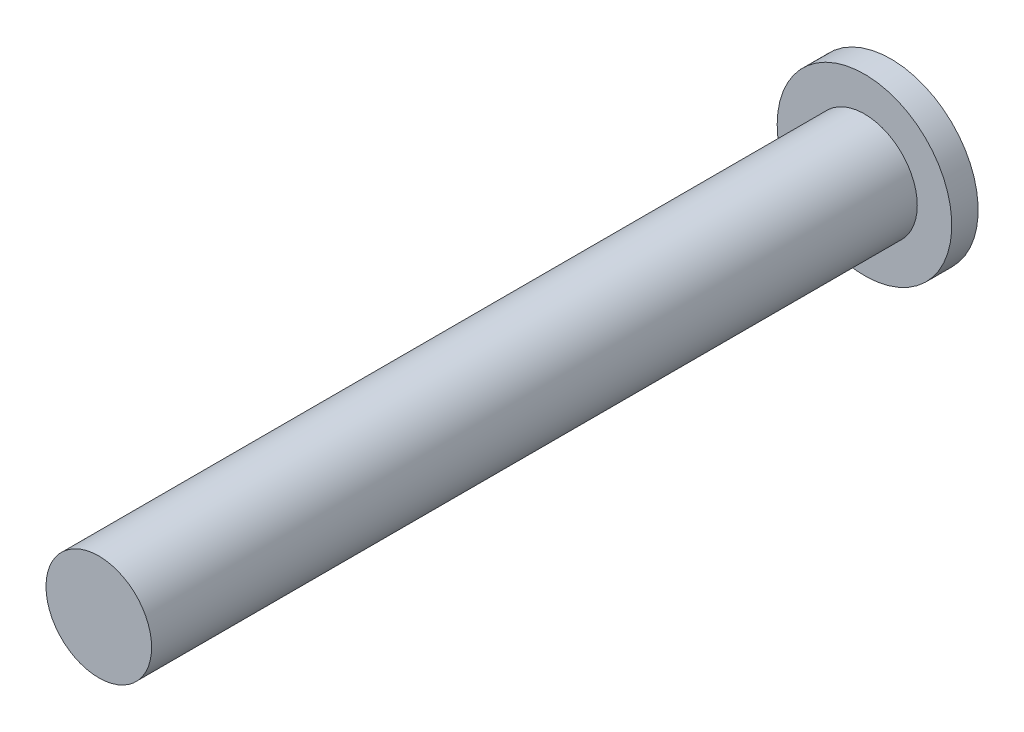
ISO-10303-21;
HEADER;
FILE_DESCRIPTION(('STEP AP214'),'2;1');
FILE_NAME('part.step','',(''),(''),'','','');
FILE_SCHEMA(('AUTOMOTIVE_DESIGN { 1 0 10303 214 1 1 1 1 }'));
ENDSEC;
DATA;
#1=APPLICATION_CONTEXT('core data for automotive mechanical design processes');
#2=APPLICATION_PROTOCOL_DEFINITION('international standard','automotive_design',2000,#1);
#3=PRODUCT_CONTEXT('',#1,'mechanical');
#4=PRODUCT('Part','Part','',(#3));
#5=PRODUCT_RELATED_PRODUCT_CATEGORY('part','',(#4));
#6=PRODUCT_DEFINITION_FORMATION('','',#4);
#7=PRODUCT_DEFINITION_CONTEXT('part definition',#1,'design');
#8=PRODUCT_DEFINITION('design','',#6,#7);
#9=PRODUCT_DEFINITION_SHAPE('','',#8);
#10=(LENGTH_UNIT() NAMED_UNIT(*) SI_UNIT(.MILLI.,.METRE.));
#11=(NAMED_UNIT(*) PLANE_ANGLE_UNIT() SI_UNIT($,.RADIAN.));
#12=(NAMED_UNIT(*) SI_UNIT($,.STERADIAN.) SOLID_ANGLE_UNIT());
#13=UNCERTAINTY_MEASURE_WITH_UNIT(LENGTH_MEASURE(1.E-05),#10,'distance_accuracy_value','');
#14=(GEOMETRIC_REPRESENTATION_CONTEXT(3) GLOBAL_UNCERTAINTY_ASSIGNED_CONTEXT((#13)) GLOBAL_UNIT_ASSIGNED_CONTEXT((#10,
#11,#12)) REPRESENTATION_CONTEXT('',''));
#15=CARTESIAN_POINT('',(0.,0.,0.));
#16=DIRECTION('',(0.,0.,1.));
#17=DIRECTION('',(1.,0.,0.));
#18=AXIS2_PLACEMENT_3D('',#15,#16,#17);
#19=CARTESIAN_POINT('',(-17.5,6.1224989991992,28.));
#20=DIRECTION('',(0.,0.,-1.));
#21=DIRECTION('',(-1.,0.,0.));
#22=AXIS2_PLACEMENT_3D('',#19,#20,#21);
#23=PLANE('',#22);
#24=CARTESIAN_POINT('',(-17.5,6.1224989991992,28.));
#25=DIRECTION('',(0.,0.,-1.));
#26=DIRECTION('',(-1.,0.,0.));
#27=AXIS2_PLACEMENT_3D('',#24,#25,#26);
#28=CIRCLE('',#27,4.);
#29=CARTESIAN_POINT('',(-21.5,6.1224989991992,28.));
#30=VERTEX_POINT('',#29);
#31=EDGE_CURVE('E10',#30,#30,#28,.T.);
#32=ORIENTED_EDGE('',*,*,#31,.F.);
#33=EDGE_LOOP('',(#32));
#34=FACE_BOUND('',#33,.T.);
#35=ADVANCED_FACE('F36',(#34),#23,.F.);
#36=CARTESIAN_POINT('',(-17.5,6.1224989991992,-41.3137084989847));
#37=DIRECTION('',(0.,0.,1.));
#38=DIRECTION('',(1.,0.,0.));
#39=AXIS2_PLACEMENT_3D('',#36,#37,#38);
#40=CYLINDRICAL_SURFACE('',#39,4.);
#41=CARTESIAN_POINT('',(-17.5,6.1224989991992,-30.));
#42=DIRECTION('',(0.,0.,1.));
#43=DIRECTION('',(1.,0.,0.));
#44=AXIS2_PLACEMENT_3D('',#41,#42,#43);
#45=CIRCLE('',#44,4.);
#46=CARTESIAN_POINT('',(-13.5,6.1224989991992,-30.));
#47=VERTEX_POINT('',#46);
#48=EDGE_CURVE('E40',#47,#47,#45,.T.);
#49=ORIENTED_EDGE('',*,*,#48,.T.);
#50=EDGE_LOOP('',(#49));
#51=FACE_BOUND('',#50,.T.);
#52=ORIENTED_EDGE('',*,*,#31,.T.);
#53=EDGE_LOOP('',(#52));
#54=FACE_BOUND('',#53,.T.);
#55=ADVANCED_FACE('F38',(#51,#54),#40,.T.);
#56=CARTESIAN_POINT('',(-17.5,6.1224989991992,-32.));
#57=DIRECTION('',(0.,0.,1.));
#58=DIRECTION('',(1.,0.,0.));
#59=AXIS2_PLACEMENT_3D('',#56,#57,#58);
#60=CYLINDRICAL_SURFACE('',#59,6.6132438330365);
#61=CARTESIAN_POINT('',(-17.5,6.1224989991992,-32.));
#62=DIRECTION('',(0.,0.,-1.));
#63=DIRECTION('',(-1.,0.,0.));
#64=AXIS2_PLACEMENT_3D('',#61,#62,#63);
#65=CIRCLE('',#64,6.6132438330365);
#66=CARTESIAN_POINT('',(-24.1132438330365,6.1224989991992,-32.));
#67=VERTEX_POINT('',#66);
#68=EDGE_CURVE('E47',#67,#67,#65,.T.);
#69=ORIENTED_EDGE('',*,*,#68,.F.);
#70=EDGE_LOOP('',(#69));
#71=FACE_BOUND('',#70,.T.);
#72=CARTESIAN_POINT('',(-17.5,6.1224989991992,-30.));
#73=DIRECTION('',(0.,0.,-1.));
#74=DIRECTION('',(-1.,0.,0.));
#75=AXIS2_PLACEMENT_3D('',#72,#73,#74);
#76=CIRCLE('',#75,6.6132438330365);
#77=CARTESIAN_POINT('',(-24.1132438330365,6.1224989991992,-30.));
#78=VERTEX_POINT('',#77);
#79=EDGE_CURVE('E49',#78,#78,#76,.T.);
#80=ORIENTED_EDGE('',*,*,#79,.T.);
#81=EDGE_LOOP('',(#80));
#82=FACE_BOUND('',#81,.T.);
#83=ADVANCED_FACE('F57',(#71,#82),#60,.T.);
#84=CARTESIAN_POINT('',(-17.5,6.1224989991992,-32.));
#85=DIRECTION('',(0.,0.,-1.));
#86=DIRECTION('',(-1.,0.,0.));
#87=AXIS2_PLACEMENT_3D('',#84,#85,#86);
#88=PLANE('',#87);
#89=ORIENTED_EDGE('',*,*,#68,.T.);
#90=EDGE_LOOP('',(#89));
#91=FACE_BOUND('',#90,.T.);
#92=ADVANCED_FACE('F55',(#91),#88,.T.);
#93=CARTESIAN_POINT('',(-17.5,6.1224989991992,-30.));
#94=DIRECTION('',(0.,0.,-1.));
#95=DIRECTION('',(-1.,0.,0.));
#96=AXIS2_PLACEMENT_3D('',#93,#94,#95);
#97=PLANE('',#96);
#98=ORIENTED_EDGE('',*,*,#48,.F.);
#99=EDGE_LOOP('',(#98));
#100=FACE_BOUND('',#99,.T.);
#101=ORIENTED_EDGE('',*,*,#79,.F.);
#102=EDGE_LOOP('',(#101));
#103=FACE_BOUND('',#102,.T.);
#104=ADVANCED_FACE('F63',(#100,#103),#97,.F.);
#105=CLOSED_SHELL('',(#35,#55,#83,#92,#104));
#106=MANIFOLD_SOLID_BREP('B2',#105);
#107=ADVANCED_BREP_SHAPE_REPRESENTATION('',(#18,#106),#14);
#108=SHAPE_DEFINITION_REPRESENTATION(#9,#107);
ENDSEC;
END-ISO-10303-21;
